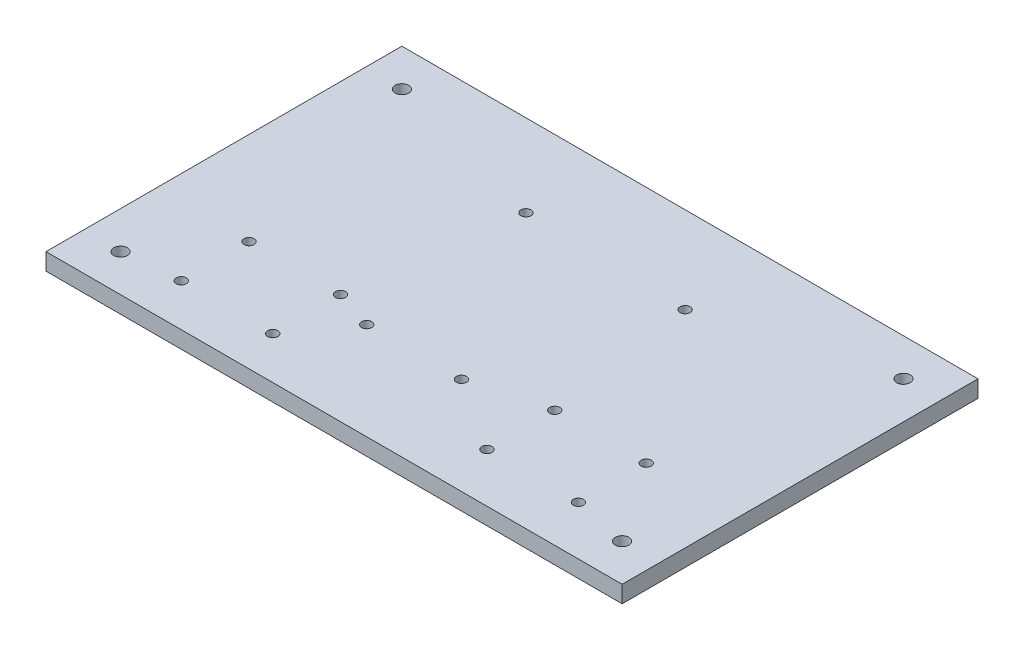
ISO-10303-21;
HEADER;
FILE_DESCRIPTION(('STEP AP214'),'2;1');
FILE_NAME('part.step','',(''),(''),'','','');
FILE_SCHEMA(('AUTOMOTIVE_DESIGN { 1 0 10303 214 1 1 1 1 }'));
ENDSEC;
DATA;
#1=APPLICATION_CONTEXT('core data for automotive mechanical design processes');
#2=APPLICATION_PROTOCOL_DEFINITION('international standard','automotive_design',2000,#1);
#3=PRODUCT_CONTEXT('',#1,'mechanical');
#4=PRODUCT('Part','Part','',(#3));
#5=PRODUCT_RELATED_PRODUCT_CATEGORY('part','',(#4));
#6=PRODUCT_DEFINITION_FORMATION('','',#4);
#7=PRODUCT_DEFINITION_CONTEXT('part definition',#1,'design');
#8=PRODUCT_DEFINITION('design','',#6,#7);
#9=PRODUCT_DEFINITION_SHAPE('','',#8);
#10=(LENGTH_UNIT() NAMED_UNIT(*) SI_UNIT(.MILLI.,.METRE.));
#11=(NAMED_UNIT(*) PLANE_ANGLE_UNIT() SI_UNIT($,.RADIAN.));
#12=(NAMED_UNIT(*) SI_UNIT($,.STERADIAN.) SOLID_ANGLE_UNIT());
#13=UNCERTAINTY_MEASURE_WITH_UNIT(LENGTH_MEASURE(1.E-05),#10,'distance_accuracy_value','');
#14=(GEOMETRIC_REPRESENTATION_CONTEXT(3) GLOBAL_UNCERTAINTY_ASSIGNED_CONTEXT((#13)) GLOBAL_UNIT_ASSIGNED_CONTEXT((#10,
#11,#12)) REPRESENTATION_CONTEXT('',''));
#15=CARTESIAN_POINT('',(0.,0.,0.));
#16=DIRECTION('',(0.,0.,1.));
#17=DIRECTION('',(1.,0.,0.));
#18=AXIS2_PLACEMENT_3D('',#15,#16,#17);
#19=CARTESIAN_POINT('',(115.6,5.,-14.5));
#20=DIRECTION('',(0.,-1.,0.));
#21=DIRECTION('',(0.,0.,-1.));
#22=AXIS2_PLACEMENT_3D('',#19,#20,#21);
#23=CYLINDRICAL_SURFACE('',#22,1.5);
#24=CARTESIAN_POINT('',(115.6,5.,-14.5));
#25=DIRECTION('',(0.,1.,0.));
#26=DIRECTION('',(0.,0.,1.));
#27=AXIS2_PLACEMENT_3D('',#24,#25,#26);
#28=CIRCLE('',#27,1.5);
#29=CARTESIAN_POINT('',(115.6,5.,-13.));
#30=VERTEX_POINT('',#29);
#31=EDGE_CURVE('E186',#30,#30,#28,.F.);
#32=ORIENTED_EDGE('',*,*,#31,.F.);
#33=EDGE_LOOP('',(#32));
#34=FACE_BOUND('',#33,.T.);
#35=CARTESIAN_POINT('',(115.6,0.,-14.5));
#36=DIRECTION('',(0.,1.,0.));
#37=DIRECTION('',(0.,0.,1.));
#38=AXIS2_PLACEMENT_3D('',#35,#36,#37);
#39=CIRCLE('',#38,1.5);
#40=CARTESIAN_POINT('',(115.6,0.,-13.));
#41=VERTEX_POINT('',#40);
#42=EDGE_CURVE('E242',#41,#41,#39,.F.);
#43=ORIENTED_EDGE('',*,*,#42,.T.);
#44=EDGE_LOOP('',(#43));
#45=FACE_BOUND('',#44,.T.);
#46=ADVANCED_FACE('F82',(#34,#45),#23,.F.);
#47=CARTESIAN_POINT('',(115.6,5.,-34.5));
#48=DIRECTION('',(0.,-1.,0.));
#49=DIRECTION('',(0.,0.,-1.));
#50=AXIS2_PLACEMENT_3D('',#47,#48,#49);
#51=CYLINDRICAL_SURFACE('',#50,1.5);
#52=CARTESIAN_POINT('',(115.6,5.,-34.5));
#53=DIRECTION('',(0.,1.,0.));
#54=DIRECTION('',(0.,0.,1.));
#55=AXIS2_PLACEMENT_3D('',#52,#53,#54);
#56=CIRCLE('',#55,1.5);
#57=CARTESIAN_POINT('',(115.6,5.,-33.));
#58=VERTEX_POINT('',#57);
#59=EDGE_CURVE('E183',#58,#58,#56,.T.);
#60=ORIENTED_EDGE('',*,*,#59,.T.);
#61=EDGE_LOOP('',(#60));
#62=FACE_BOUND('',#61,.T.);
#63=CARTESIAN_POINT('',(115.6,0.,-34.5));
#64=DIRECTION('',(0.,1.,0.));
#65=DIRECTION('',(0.,0.,1.));
#66=AXIS2_PLACEMENT_3D('',#63,#64,#65);
#67=CIRCLE('',#66,1.5);
#68=CARTESIAN_POINT('',(115.6,0.,-33.));
#69=VERTEX_POINT('',#68);
#70=EDGE_CURVE('E239',#69,#69,#67,.T.);
#71=ORIENTED_EDGE('',*,*,#70,.F.);
#72=EDGE_LOOP('',(#71));
#73=FACE_BOUND('',#72,.T.);
#74=ADVANCED_FACE('F270',(#62,#73),#51,.F.);
#75=CARTESIAN_POINT('',(142.6,5.,-34.5));
#76=DIRECTION('',(0.,-1.,0.));
#77=DIRECTION('',(0.,0.,-1.));
#78=AXIS2_PLACEMENT_3D('',#75,#76,#77);
#79=CYLINDRICAL_SURFACE('',#78,1.5);
#80=CARTESIAN_POINT('',(142.6,5.,-34.5));
#81=DIRECTION('',(0.,1.,0.));
#82=DIRECTION('',(0.,0.,1.));
#83=AXIS2_PLACEMENT_3D('',#80,#81,#82);
#84=CIRCLE('',#83,1.5);
#85=CARTESIAN_POINT('',(142.6,5.,-33.));
#86=VERTEX_POINT('',#85);
#87=EDGE_CURVE('E180',#86,#86,#84,.T.);
#88=ORIENTED_EDGE('',*,*,#87,.T.);
#89=EDGE_LOOP('',(#88));
#90=FACE_BOUND('',#89,.T.);
#91=CARTESIAN_POINT('',(142.6,0.,-34.5));
#92=DIRECTION('',(0.,1.,0.));
#93=DIRECTION('',(0.,0.,1.));
#94=AXIS2_PLACEMENT_3D('',#91,#92,#93);
#95=CIRCLE('',#94,1.5);
#96=CARTESIAN_POINT('',(142.6,0.,-33.));
#97=VERTEX_POINT('',#96);
#98=EDGE_CURVE('E236',#97,#97,#95,.T.);
#99=ORIENTED_EDGE('',*,*,#98,.F.);
#100=EDGE_LOOP('',(#99));
#101=FACE_BOUND('',#100,.T.);
#102=ADVANCED_FACE('F276',(#90,#101),#79,.F.);
#103=CARTESIAN_POINT('',(142.6,5.,-14.5));
#104=DIRECTION('',(0.,-1.,0.));
#105=DIRECTION('',(0.,0.,-1.));
#106=AXIS2_PLACEMENT_3D('',#103,#104,#105);
#107=CYLINDRICAL_SURFACE('',#106,1.5);
#108=CARTESIAN_POINT('',(142.6,5.,-14.5));
#109=DIRECTION('',(0.,1.,0.));
#110=DIRECTION('',(0.,0.,1.));
#111=AXIS2_PLACEMENT_3D('',#108,#109,#110);
#112=CIRCLE('',#111,1.5);
#113=CARTESIAN_POINT('',(142.6,5.,-13.));
#114=VERTEX_POINT('',#113);
#115=EDGE_CURVE('E177',#114,#114,#112,.F.);
#116=ORIENTED_EDGE('',*,*,#115,.F.);
#117=EDGE_LOOP('',(#116));
#118=FACE_BOUND('',#117,.T.);
#119=CARTESIAN_POINT('',(142.6,0.,-14.5));
#120=DIRECTION('',(0.,1.,0.));
#121=DIRECTION('',(0.,0.,1.));
#122=AXIS2_PLACEMENT_3D('',#119,#120,#121);
#123=CIRCLE('',#122,1.5);
#124=CARTESIAN_POINT('',(142.6,0.,-13.));
#125=VERTEX_POINT('',#124);
#126=EDGE_CURVE('E233',#125,#125,#123,.F.);
#127=ORIENTED_EDGE('',*,*,#126,.T.);
#128=EDGE_LOOP('',(#127));
#129=FACE_BOUND('',#128,.T.);
#130=ADVANCED_FACE('F283',(#118,#129),#107,.F.);
#131=CARTESIAN_POINT('',(60.88,5.,-80.73));
#132=DIRECTION('',(0.,-1.,0.));
#133=DIRECTION('',(0.,0.,-1.));
#134=AXIS2_PLACEMENT_3D('',#131,#132,#133);
#135=CYLINDRICAL_SURFACE('',#134,1.5);
#136=CARTESIAN_POINT('',(60.88,5.,-80.73));
#137=DIRECTION('',(0.,1.,0.));
#138=DIRECTION('',(0.,0.,1.));
#139=AXIS2_PLACEMENT_3D('',#136,#137,#138);
#140=CIRCLE('',#139,1.5);
#141=CARTESIAN_POINT('',(60.88,5.,-79.23));
#142=VERTEX_POINT('',#141);
#143=EDGE_CURVE('E174',#142,#142,#140,.T.);
#144=ORIENTED_EDGE('',*,*,#143,.T.);
#145=EDGE_LOOP('',(#144));
#146=FACE_BOUND('',#145,.T.);
#147=CARTESIAN_POINT('',(60.88,0.,-80.73));
#148=DIRECTION('',(0.,1.,0.));
#149=DIRECTION('',(0.,0.,1.));
#150=AXIS2_PLACEMENT_3D('',#147,#148,#149);
#151=CIRCLE('',#150,1.5);
#152=CARTESIAN_POINT('',(60.88,0.,-79.23));
#153=VERTEX_POINT('',#152);
#154=EDGE_CURVE('E230',#153,#153,#151,.T.);
#155=ORIENTED_EDGE('',*,*,#154,.F.);
#156=EDGE_LOOP('',(#155));
#157=FACE_BOUND('',#156,.T.);
#158=ADVANCED_FACE('F287',(#146,#157),#135,.F.);
#159=CARTESIAN_POINT('',(65.97,5.,-28.66));
#160=DIRECTION('',(0.,-1.,0.));
#161=DIRECTION('',(0.,0.,-1.));
#162=AXIS2_PLACEMENT_3D('',#159,#160,#161);
#163=CYLINDRICAL_SURFACE('',#162,1.5);
#164=CARTESIAN_POINT('',(65.97,5.,-28.66));
#165=DIRECTION('',(0.,1.,0.));
#166=DIRECTION('',(0.,0.,1.));
#167=AXIS2_PLACEMENT_3D('',#164,#165,#166);
#168=CIRCLE('',#167,1.5);
#169=CARTESIAN_POINT('',(65.97,5.,-27.16));
#170=VERTEX_POINT('',#169);
#171=EDGE_CURVE('E171',#170,#170,#168,.T.);
#172=ORIENTED_EDGE('',*,*,#171,.T.);
#173=EDGE_LOOP('',(#172));
#174=FACE_BOUND('',#173,.T.);
#175=CARTESIAN_POINT('',(65.97,0.,-28.66));
#176=DIRECTION('',(0.,1.,0.));
#177=DIRECTION('',(0.,0.,1.));
#178=AXIS2_PLACEMENT_3D('',#175,#176,#177);
#179=CIRCLE('',#178,1.5);
#180=CARTESIAN_POINT('',(65.97,0.,-27.16));
#181=VERTEX_POINT('',#180);
#182=EDGE_CURVE('E227',#181,#181,#179,.T.);
#183=ORIENTED_EDGE('',*,*,#182,.F.);
#184=EDGE_LOOP('',(#183));
#185=FACE_BOUND('',#184,.T.);
#186=ADVANCED_FACE('F291',(#174,#185),#163,.F.);
#187=CARTESIAN_POINT('',(93.92,5.,-28.66));
#188=DIRECTION('',(0.,-1.,0.));
#189=DIRECTION('',(0.,0.,-1.));
#190=AXIS2_PLACEMENT_3D('',#187,#188,#189);
#191=CYLINDRICAL_SURFACE('',#190,1.5);
#192=CARTESIAN_POINT('',(93.92,5.,-28.66));
#193=DIRECTION('',(0.,1.,0.));
#194=DIRECTION('',(0.,0.,1.));
#195=AXIS2_PLACEMENT_3D('',#192,#193,#194);
#196=CIRCLE('',#195,1.5);
#197=CARTESIAN_POINT('',(93.92,5.,-27.16));
#198=VERTEX_POINT('',#197);
#199=EDGE_CURVE('E168',#198,#198,#196,.T.);
#200=ORIENTED_EDGE('',*,*,#199,.T.);
#201=EDGE_LOOP('',(#200));
#202=FACE_BOUND('',#201,.T.);
#203=CARTESIAN_POINT('',(93.92,0.,-28.66));
#204=DIRECTION('',(0.,1.,0.));
#205=DIRECTION('',(0.,0.,1.));
#206=AXIS2_PLACEMENT_3D('',#203,#204,#205);
#207=CIRCLE('',#206,1.5);
#208=CARTESIAN_POINT('',(93.92,0.,-27.16));
#209=VERTEX_POINT('',#208);
#210=EDGE_CURVE('E224',#209,#209,#207,.T.);
#211=ORIENTED_EDGE('',*,*,#210,.F.);
#212=EDGE_LOOP('',(#211));
#213=FACE_BOUND('',#212,.T.);
#214=ADVANCED_FACE('F295',(#202,#213),#191,.F.);
#215=CARTESIAN_POINT('',(109.12,5.,-79.45));
#216=DIRECTION('',(0.,-1.,0.));
#217=DIRECTION('',(0.,0.,-1.));
#218=AXIS2_PLACEMENT_3D('',#215,#216,#217);
#219=CYLINDRICAL_SURFACE('',#218,1.5);
#220=CARTESIAN_POINT('',(109.12,5.,-79.45));
#221=DIRECTION('',(0.,1.,0.));
#222=DIRECTION('',(0.,0.,1.));
#223=AXIS2_PLACEMENT_3D('',#220,#221,#222);
#224=CIRCLE('',#223,1.5);
#225=CARTESIAN_POINT('',(109.12,5.,-77.95));
#226=VERTEX_POINT('',#225);
#227=EDGE_CURVE('E165',#226,#226,#224,.T.);
#228=ORIENTED_EDGE('',*,*,#227,.T.);
#229=EDGE_LOOP('',(#228));
#230=FACE_BOUND('',#229,.T.);
#231=CARTESIAN_POINT('',(109.12,0.,-79.45));
#232=DIRECTION('',(0.,1.,0.));
#233=DIRECTION('',(0.,0.,1.));
#234=AXIS2_PLACEMENT_3D('',#231,#232,#233);
#235=CIRCLE('',#234,1.5);
#236=CARTESIAN_POINT('',(109.12,0.,-77.95));
#237=VERTEX_POINT('',#236);
#238=EDGE_CURVE('E221',#237,#237,#235,.T.);
#239=ORIENTED_EDGE('',*,*,#238,.F.);
#240=EDGE_LOOP('',(#239));
#241=FACE_BOUND('',#240,.T.);
#242=ADVANCED_FACE('F299',(#230,#241),#219,.F.);
#243=CARTESIAN_POINT('',(27.4,5.,-32.5));
#244=DIRECTION('',(0.,-1.,0.));
#245=DIRECTION('',(0.,0.,-1.));
#246=AXIS2_PLACEMENT_3D('',#243,#244,#245);
#247=CYLINDRICAL_SURFACE('',#246,1.5);
#248=CARTESIAN_POINT('',(27.4,5.,-32.5));
#249=DIRECTION('',(0.,1.,0.));
#250=DIRECTION('',(0.,0.,1.));
#251=AXIS2_PLACEMENT_3D('',#248,#249,#250);
#252=CIRCLE('',#251,1.5);
#253=CARTESIAN_POINT('',(27.4,5.,-31.));
#254=VERTEX_POINT('',#253);
#255=EDGE_CURVE('E162',#254,#254,#252,.F.);
#256=ORIENTED_EDGE('',*,*,#255,.F.);
#257=EDGE_LOOP('',(#256));
#258=FACE_BOUND('',#257,.T.);
#259=CARTESIAN_POINT('',(27.4,0.,-32.5));
#260=DIRECTION('',(0.,1.,0.));
#261=DIRECTION('',(0.,0.,1.));
#262=AXIS2_PLACEMENT_3D('',#259,#260,#261);
#263=CIRCLE('',#262,1.5);
#264=CARTESIAN_POINT('',(27.4,0.,-31.));
#265=VERTEX_POINT('',#264);
#266=EDGE_CURVE('E218',#265,#265,#263,.F.);
#267=ORIENTED_EDGE('',*,*,#266,.T.);
#268=EDGE_LOOP('',(#267));
#269=FACE_BOUND('',#268,.T.);
#270=ADVANCED_FACE('F303',(#258,#269),#247,.F.);
#271=CARTESIAN_POINT('',(54.4,5.,-12.5));
#272=DIRECTION('',(0.,-1.,0.));
#273=DIRECTION('',(0.,0.,-1.));
#274=AXIS2_PLACEMENT_3D('',#271,#272,#273);
#275=CYLINDRICAL_SURFACE('',#274,1.5);
#276=CARTESIAN_POINT('',(54.4,5.,-12.5));
#277=DIRECTION('',(0.,1.,0.));
#278=DIRECTION('',(0.,0.,1.));
#279=AXIS2_PLACEMENT_3D('',#276,#277,#278);
#280=CIRCLE('',#279,1.5);
#281=CARTESIAN_POINT('',(54.4,5.,-11.));
#282=VERTEX_POINT('',#281);
#283=EDGE_CURVE('E159',#282,#282,#280,.T.);
#284=ORIENTED_EDGE('',*,*,#283,.T.);
#285=EDGE_LOOP('',(#284));
#286=FACE_BOUND('',#285,.T.);
#287=CARTESIAN_POINT('',(54.4,0.,-12.5));
#288=DIRECTION('',(0.,1.,0.));
#289=DIRECTION('',(0.,0.,1.));
#290=AXIS2_PLACEMENT_3D('',#287,#288,#289);
#291=CIRCLE('',#290,1.5);
#292=CARTESIAN_POINT('',(54.4,0.,-11.));
#293=VERTEX_POINT('',#292);
#294=EDGE_CURVE('E215',#293,#293,#291,.T.);
#295=ORIENTED_EDGE('',*,*,#294,.F.);
#296=EDGE_LOOP('',(#295));
#297=FACE_BOUND('',#296,.T.);
#298=ADVANCED_FACE('F307',(#286,#297),#275,.F.);
#299=CARTESIAN_POINT('',(27.4,5.,-12.5));
#300=DIRECTION('',(0.,-1.,0.));
#301=DIRECTION('',(0.,0.,-1.));
#302=AXIS2_PLACEMENT_3D('',#299,#300,#301);
#303=CYLINDRICAL_SURFACE('',#302,1.5);
#304=CARTESIAN_POINT('',(27.4,5.,-12.5));
#305=DIRECTION('',(0.,1.,0.));
#306=DIRECTION('',(0.,0.,1.));
#307=AXIS2_PLACEMENT_3D('',#304,#305,#306);
#308=CIRCLE('',#307,1.5);
#309=CARTESIAN_POINT('',(27.4,5.,-11.));
#310=VERTEX_POINT('',#309);
#311=EDGE_CURVE('E156',#310,#310,#308,.T.);
#312=ORIENTED_EDGE('',*,*,#311,.T.);
#313=EDGE_LOOP('',(#312));
#314=FACE_BOUND('',#313,.T.);
#315=CARTESIAN_POINT('',(27.4,0.,-12.5));
#316=DIRECTION('',(0.,1.,0.));
#317=DIRECTION('',(0.,0.,1.));
#318=AXIS2_PLACEMENT_3D('',#315,#316,#317);
#319=CIRCLE('',#318,1.5);
#320=CARTESIAN_POINT('',(27.4,0.,-11.));
#321=VERTEX_POINT('',#320);
#322=EDGE_CURVE('E212',#321,#321,#319,.T.);
#323=ORIENTED_EDGE('',*,*,#322,.F.);
#324=EDGE_LOOP('',(#323));
#325=FACE_BOUND('',#324,.T.);
#326=ADVANCED_FACE('F311',(#314,#325),#303,.F.);
#327=CARTESIAN_POINT('',(54.4,5.,-32.5));
#328=DIRECTION('',(0.,-1.,0.));
#329=DIRECTION('',(0.,0.,-1.));
#330=AXIS2_PLACEMENT_3D('',#327,#328,#329);
#331=CYLINDRICAL_SURFACE('',#330,1.5);
#332=CARTESIAN_POINT('',(54.4,5.,-32.5));
#333=DIRECTION('',(0.,1.,0.));
#334=DIRECTION('',(0.,0.,1.));
#335=AXIS2_PLACEMENT_3D('',#332,#333,#334);
#336=CIRCLE('',#335,1.5);
#337=CARTESIAN_POINT('',(54.4,5.,-31.));
#338=VERTEX_POINT('',#337);
#339=EDGE_CURVE('E153',#338,#338,#336,.F.);
#340=ORIENTED_EDGE('',*,*,#339,.F.);
#341=EDGE_LOOP('',(#340));
#342=FACE_BOUND('',#341,.T.);
#343=CARTESIAN_POINT('',(54.4,0.,-32.5));
#344=DIRECTION('',(0.,1.,0.));
#345=DIRECTION('',(0.,0.,1.));
#346=AXIS2_PLACEMENT_3D('',#343,#344,#345);
#347=CIRCLE('',#346,1.5);
#348=CARTESIAN_POINT('',(54.4,0.,-31.));
#349=VERTEX_POINT('',#348);
#350=EDGE_CURVE('E209',#349,#349,#347,.F.);
#351=ORIENTED_EDGE('',*,*,#350,.T.);
#352=EDGE_LOOP('',(#351));
#353=FACE_BOUND('',#352,.T.);
#354=ADVANCED_FACE('F315',(#342,#353),#331,.F.);
#355=CARTESIAN_POINT('',(159.,5.,-94.));
#356=DIRECTION('',(0.,-1.,0.));
#357=DIRECTION('',(0.,0.,-1.));
#358=AXIS2_PLACEMENT_3D('',#355,#356,#357);
#359=CYLINDRICAL_SURFACE('',#358,2.);
#360=CARTESIAN_POINT('',(159.,5.,-94.));
#361=DIRECTION('',(0.,1.,0.));
#362=DIRECTION('',(0.,0.,1.));
#363=AXIS2_PLACEMENT_3D('',#360,#361,#362);
#364=CIRCLE('',#363,2.);
#365=CARTESIAN_POINT('',(159.,5.,-92.));
#366=VERTEX_POINT('',#365);
#367=EDGE_CURVE('E150',#366,#366,#364,.F.);
#368=ORIENTED_EDGE('',*,*,#367,.F.);
#369=EDGE_LOOP('',(#368));
#370=FACE_BOUND('',#369,.T.);
#371=CARTESIAN_POINT('',(159.,0.,-94.));
#372=DIRECTION('',(0.,1.,0.));
#373=DIRECTION('',(0.,0.,1.));
#374=AXIS2_PLACEMENT_3D('',#371,#372,#373);
#375=CIRCLE('',#374,2.);
#376=CARTESIAN_POINT('',(159.,0.,-92.));
#377=VERTEX_POINT('',#376);
#378=EDGE_CURVE('E206',#377,#377,#375,.F.);
#379=ORIENTED_EDGE('',*,*,#378,.T.);
#380=EDGE_LOOP('',(#379));
#381=FACE_BOUND('',#380,.T.);
#382=ADVANCED_FACE('F319',(#370,#381),#359,.F.);
#383=CARTESIAN_POINT('',(159.,5.,-11.));
#384=DIRECTION('',(0.,-1.,0.));
#385=DIRECTION('',(0.,0.,-1.));
#386=AXIS2_PLACEMENT_3D('',#383,#384,#385);
#387=CYLINDRICAL_SURFACE('',#386,2.);
#388=CARTESIAN_POINT('',(159.,5.,-11.));
#389=DIRECTION('',(0.,1.,0.));
#390=DIRECTION('',(0.,0.,1.));
#391=AXIS2_PLACEMENT_3D('',#388,#389,#390);
#392=CIRCLE('',#391,2.);
#393=CARTESIAN_POINT('',(159.,5.,-9.00000000000003));
#394=VERTEX_POINT('',#393);
#395=EDGE_CURVE('E144',#394,#394,#392,.T.);
#396=ORIENTED_EDGE('',*,*,#395,.T.);
#397=EDGE_LOOP('',(#396));
#398=FACE_BOUND('',#397,.T.);
#399=CARTESIAN_POINT('',(159.,0.,-11.));
#400=DIRECTION('',(0.,1.,0.));
#401=DIRECTION('',(0.,0.,1.));
#402=AXIS2_PLACEMENT_3D('',#399,#400,#401);
#403=CIRCLE('',#402,2.);
#404=CARTESIAN_POINT('',(159.,0.,-9.00000000000003));
#405=VERTEX_POINT('',#404);
#406=EDGE_CURVE('E203',#405,#405,#403,.T.);
#407=ORIENTED_EDGE('',*,*,#406,.F.);
#408=EDGE_LOOP('',(#407));
#409=FACE_BOUND('',#408,.T.);
#410=ADVANCED_FACE('F323',(#398,#409),#387,.F.);
#411=CARTESIAN_POINT('',(170.,5.,0.));
#412=DIRECTION('',(-1.,0.,0.));
#413=DIRECTION('',(0.,0.,1.));
#414=AXIS2_PLACEMENT_3D('',#411,#412,#413);
#415=PLANE('',#414);
#416=DIRECTION('',(0.,0.,-1.));
#417=VECTOR('',#416,1.);
#418=CARTESIAN_POINT('',(170.,0.,0.));
#419=LINE('',#418,#417);
#420=CARTESIAN_POINT('',(170.,0.,0.));
#421=VERTEX_POINT('',#420);
#422=CARTESIAN_POINT('',(170.,0.,-105.));
#423=VERTEX_POINT('',#422);
#424=EDGE_CURVE('E138',#421,#423,#419,.T.);
#425=ORIENTED_EDGE('',*,*,#424,.T.);
#426=DIRECTION('',(0.,-1.,0.));
#427=VECTOR('',#426,1.);
#428=CARTESIAN_POINT('',(170.,5.,-105.));
#429=LINE('',#428,#427);
#430=CARTESIAN_POINT('',(170.,5.,-105.));
#431=VERTEX_POINT('',#430);
#432=EDGE_CURVE('E91',#431,#423,#429,.T.);
#433=ORIENTED_EDGE('',*,*,#432,.F.);
#434=DIRECTION('',(0.,0.,-1.));
#435=VECTOR('',#434,1.);
#436=CARTESIAN_POINT('',(170.,5.,0.));
#437=LINE('',#436,#435);
#438=CARTESIAN_POINT('',(170.,5.,0.));
#439=VERTEX_POINT('',#438);
#440=EDGE_CURVE('E124',#439,#431,#437,.T.);
#441=ORIENTED_EDGE('',*,*,#440,.F.);
#442=DIRECTION('',(0.,-1.,0.));
#443=VECTOR('',#442,1.);
#444=CARTESIAN_POINT('',(170.,5.,0.));
#445=LINE('',#444,#443);
#446=EDGE_CURVE('E12',#439,#421,#445,.T.);
#447=ORIENTED_EDGE('',*,*,#446,.T.);
#448=EDGE_LOOP('',(#425,#433,#441,#447));
#449=FACE_BOUND('',#448,.T.);
#450=ADVANCED_FACE('F137',(#449),#415,.F.);
#451=CARTESIAN_POINT('',(0.,5.,-105.));
#452=DIRECTION('',(0.,0.,-1.));
#453=DIRECTION('',(-1.,0.,0.));
#454=AXIS2_PLACEMENT_3D('',#451,#452,#453);
#455=PLANE('',#454);
#456=DIRECTION('',(1.,0.,0.));
#457=VECTOR('',#456,1.);
#458=CARTESIAN_POINT('',(0.,0.,-105.));
#459=LINE('',#458,#457);
#460=CARTESIAN_POINT('',(0.,0.,-105.));
#461=VERTEX_POINT('',#460);
#462=EDGE_CURVE('E198',#461,#423,#459,.T.);
#463=ORIENTED_EDGE('',*,*,#462,.F.);
#464=DIRECTION('',(0.,-1.,0.));
#465=VECTOR('',#464,1.);
#466=CARTESIAN_POINT('',(0.,5.,-105.));
#467=LINE('',#466,#465);
#468=CARTESIAN_POINT('',(0.,5.,-105.));
#469=VERTEX_POINT('',#468);
#470=EDGE_CURVE('E113',#469,#461,#467,.T.);
#471=ORIENTED_EDGE('',*,*,#470,.F.);
#472=DIRECTION('',(1.,0.,0.));
#473=VECTOR('',#472,1.);
#474=CARTESIAN_POINT('',(0.,5.,-105.));
#475=LINE('',#474,#473);
#476=EDGE_CURVE('E132',#469,#431,#475,.T.);
#477=ORIENTED_EDGE('',*,*,#476,.T.);
#478=ORIENTED_EDGE('',*,*,#432,.T.);
#479=EDGE_LOOP('',(#463,#471,#477,#478));
#480=FACE_BOUND('',#479,.T.);
#481=ADVANCED_FACE('F141',(#480),#455,.T.);
#482=CARTESIAN_POINT('',(0.,5.,0.));
#483=DIRECTION('',(-1.,0.,0.));
#484=DIRECTION('',(0.,0.,1.));
#485=AXIS2_PLACEMENT_3D('',#482,#483,#484);
#486=PLANE('',#485);
#487=DIRECTION('',(0.,0.,-1.));
#488=VECTOR('',#487,1.);
#489=CARTESIAN_POINT('',(0.,0.,0.));
#490=LINE('',#489,#488);
#491=CARTESIAN_POINT('',(0.,0.,0.));
#492=VERTEX_POINT('',#491);
#493=EDGE_CURVE('E200',#492,#461,#490,.T.);
#494=ORIENTED_EDGE('',*,*,#493,.F.);
#495=DIRECTION('',(0.,-1.,0.));
#496=VECTOR('',#495,1.);
#497=CARTESIAN_POINT('',(0.,5.,0.));
#498=LINE('',#497,#496);
#499=CARTESIAN_POINT('',(0.,5.,0.));
#500=VERTEX_POINT('',#499);
#501=EDGE_CURVE('E99',#500,#492,#498,.T.);
#502=ORIENTED_EDGE('',*,*,#501,.F.);
#503=DIRECTION('',(0.,0.,-1.));
#504=VECTOR('',#503,1.);
#505=CARTESIAN_POINT('',(0.,5.,0.));
#506=LINE('',#505,#504);
#507=EDGE_CURVE('E142',#500,#469,#506,.T.);
#508=ORIENTED_EDGE('',*,*,#507,.T.);
#509=ORIENTED_EDGE('',*,*,#470,.T.);
#510=EDGE_LOOP('',(#494,#502,#508,#509));
#511=FACE_BOUND('',#510,.T.);
#512=ADVANCED_FACE('F328',(#511),#486,.T.);
#513=CARTESIAN_POINT('',(0.,5.,0.));
#514=DIRECTION('',(0.,0.,-1.));
#515=DIRECTION('',(-1.,0.,0.));
#516=AXIS2_PLACEMENT_3D('',#513,#514,#515);
#517=PLANE('',#516);
#518=DIRECTION('',(1.,0.,0.));
#519=VECTOR('',#518,1.);
#520=CARTESIAN_POINT('',(0.,0.,0.));
#521=LINE('',#520,#519);
#522=EDGE_CURVE('E195',#492,#421,#521,.T.);
#523=ORIENTED_EDGE('',*,*,#522,.T.);
#524=ORIENTED_EDGE('',*,*,#446,.F.);
#525=DIRECTION('',(1.,0.,0.));
#526=VECTOR('',#525,1.);
#527=CARTESIAN_POINT('',(0.,5.,0.));
#528=LINE('',#527,#526);
#529=EDGE_CURVE('E133',#500,#439,#528,.T.);
#530=ORIENTED_EDGE('',*,*,#529,.F.);
#531=ORIENTED_EDGE('',*,*,#501,.T.);
#532=EDGE_LOOP('',(#523,#524,#530,#531));
#533=FACE_BOUND('',#532,.T.);
#534=ADVANCED_FACE('F331',(#533),#517,.F.);
#535=CARTESIAN_POINT('',(11.,5.,-94.));
#536=DIRECTION('',(0.,-1.,0.));
#537=DIRECTION('',(0.,0.,-1.));
#538=AXIS2_PLACEMENT_3D('',#535,#536,#537);
#539=CYLINDRICAL_SURFACE('',#538,2.);
#540=CARTESIAN_POINT('',(11.,5.,-94.));
#541=DIRECTION('',(0.,1.,0.));
#542=DIRECTION('',(0.,0.,1.));
#543=AXIS2_PLACEMENT_3D('',#540,#541,#542);
#544=CIRCLE('',#543,2.);
#545=CARTESIAN_POINT('',(11.,5.,-92.));
#546=VERTEX_POINT('',#545);
#547=EDGE_CURVE('E250',#546,#546,#544,.T.);
#548=ORIENTED_EDGE('',*,*,#547,.T.);
#549=EDGE_LOOP('',(#548));
#550=FACE_BOUND('',#549,.T.);
#551=CARTESIAN_POINT('',(11.,0.,-94.));
#552=DIRECTION('',(0.,1.,0.));
#553=DIRECTION('',(0.,0.,1.));
#554=AXIS2_PLACEMENT_3D('',#551,#552,#553);
#555=CIRCLE('',#554,2.);
#556=CARTESIAN_POINT('',(11.,0.,-92.));
#557=VERTEX_POINT('',#556);
#558=EDGE_CURVE('E192',#557,#557,#555,.T.);
#559=ORIENTED_EDGE('',*,*,#558,.F.);
#560=EDGE_LOOP('',(#559));
#561=FACE_BOUND('',#560,.T.);
#562=ADVANCED_FACE('F258',(#550,#561),#539,.F.);
#563=CARTESIAN_POINT('',(11.,5.,-11.));
#564=DIRECTION('',(0.,-1.,0.));
#565=DIRECTION('',(0.,0.,-1.));
#566=AXIS2_PLACEMENT_3D('',#563,#564,#565);
#567=CYLINDRICAL_SURFACE('',#566,2.);
#568=CARTESIAN_POINT('',(11.,5.,-11.));
#569=DIRECTION('',(0.,1.,0.));
#570=DIRECTION('',(0.,0.,1.));
#571=AXIS2_PLACEMENT_3D('',#568,#569,#570);
#572=CIRCLE('',#571,2.);
#573=CARTESIAN_POINT('',(11.,5.,-9.));
#574=VERTEX_POINT('',#573);
#575=EDGE_CURVE('E245',#574,#574,#572,.F.);
#576=ORIENTED_EDGE('',*,*,#575,.F.);
#577=EDGE_LOOP('',(#576));
#578=FACE_BOUND('',#577,.T.);
#579=CARTESIAN_POINT('',(11.,0.,-11.));
#580=DIRECTION('',(0.,1.,0.));
#581=DIRECTION('',(0.,0.,1.));
#582=AXIS2_PLACEMENT_3D('',#579,#580,#581);
#583=CIRCLE('',#582,2.);
#584=CARTESIAN_POINT('',(11.,0.,-9.));
#585=VERTEX_POINT('',#584);
#586=EDGE_CURVE('E189',#585,#585,#583,.F.);
#587=ORIENTED_EDGE('',*,*,#586,.T.);
#588=EDGE_LOOP('',(#587));
#589=FACE_BOUND('',#588,.T.);
#590=ADVANCED_FACE('F84',(#578,#589),#567,.F.);
#591=CARTESIAN_POINT('',(0.,0.,0.));
#592=DIRECTION('',(0.,1.,0.));
#593=DIRECTION('',(0.,0.,1.));
#594=AXIS2_PLACEMENT_3D('',#591,#592,#593);
#595=PLANE('',#594);
#596=ORIENTED_EDGE('',*,*,#586,.F.);
#597=EDGE_LOOP('',(#596));
#598=FACE_BOUND('',#597,.T.);
#599=ORIENTED_EDGE('',*,*,#558,.T.);
#600=EDGE_LOOP('',(#599));
#601=FACE_BOUND('',#600,.T.);
#602=ORIENTED_EDGE('',*,*,#522,.F.);
#603=ORIENTED_EDGE('',*,*,#493,.T.);
#604=ORIENTED_EDGE('',*,*,#462,.T.);
#605=ORIENTED_EDGE('',*,*,#424,.F.);
#606=EDGE_LOOP('',(#602,#603,#604,#605));
#607=FACE_BOUND('',#606,.T.);
#608=ORIENTED_EDGE('',*,*,#406,.T.);
#609=EDGE_LOOP('',(#608));
#610=FACE_BOUND('',#609,.T.);
#611=ORIENTED_EDGE('',*,*,#378,.F.);
#612=EDGE_LOOP('',(#611));
#613=FACE_BOUND('',#612,.T.);
#614=ORIENTED_EDGE('',*,*,#350,.F.);
#615=EDGE_LOOP('',(#614));
#616=FACE_BOUND('',#615,.T.);
#617=ORIENTED_EDGE('',*,*,#322,.T.);
#618=EDGE_LOOP('',(#617));
#619=FACE_BOUND('',#618,.T.);
#620=ORIENTED_EDGE('',*,*,#294,.T.);
#621=EDGE_LOOP('',(#620));
#622=FACE_BOUND('',#621,.T.);
#623=ORIENTED_EDGE('',*,*,#266,.F.);
#624=EDGE_LOOP('',(#623));
#625=FACE_BOUND('',#624,.T.);
#626=ORIENTED_EDGE('',*,*,#238,.T.);
#627=EDGE_LOOP('',(#626));
#628=FACE_BOUND('',#627,.T.);
#629=ORIENTED_EDGE('',*,*,#210,.T.);
#630=EDGE_LOOP('',(#629));
#631=FACE_BOUND('',#630,.T.);
#632=ORIENTED_EDGE('',*,*,#182,.T.);
#633=EDGE_LOOP('',(#632));
#634=FACE_BOUND('',#633,.T.);
#635=ORIENTED_EDGE('',*,*,#154,.T.);
#636=EDGE_LOOP('',(#635));
#637=FACE_BOUND('',#636,.T.);
#638=ORIENTED_EDGE('',*,*,#126,.F.);
#639=EDGE_LOOP('',(#638));
#640=FACE_BOUND('',#639,.T.);
#641=ORIENTED_EDGE('',*,*,#98,.T.);
#642=EDGE_LOOP('',(#641));
#643=FACE_BOUND('',#642,.T.);
#644=ORIENTED_EDGE('',*,*,#70,.T.);
#645=EDGE_LOOP('',(#644));
#646=FACE_BOUND('',#645,.T.);
#647=ORIENTED_EDGE('',*,*,#42,.F.);
#648=EDGE_LOOP('',(#647));
#649=FACE_BOUND('',#648,.T.);
#650=ADVANCED_FACE('F262',(#598,#601,#607,#610,#613,#616,#619,#622,#625,#628,#631,#634,#637,
#640,#643,#646,#649),#595,.F.);
#651=CARTESIAN_POINT('',(0.,5.,0.));
#652=DIRECTION('',(0.,1.,0.));
#653=DIRECTION('',(0.,0.,1.));
#654=AXIS2_PLACEMENT_3D('',#651,#652,#653);
#655=PLANE('',#654);
#656=ORIENTED_EDGE('',*,*,#575,.T.);
#657=EDGE_LOOP('',(#656));
#658=FACE_BOUND('',#657,.T.);
#659=ORIENTED_EDGE('',*,*,#547,.F.);
#660=EDGE_LOOP('',(#659));
#661=FACE_BOUND('',#660,.T.);
#662=ORIENTED_EDGE('',*,*,#529,.T.);
#663=ORIENTED_EDGE('',*,*,#440,.T.);
#664=ORIENTED_EDGE('',*,*,#476,.F.);
#665=ORIENTED_EDGE('',*,*,#507,.F.);
#666=EDGE_LOOP('',(#662,#663,#664,#665));
#667=FACE_BOUND('',#666,.T.);
#668=ORIENTED_EDGE('',*,*,#395,.F.);
#669=EDGE_LOOP('',(#668));
#670=FACE_BOUND('',#669,.T.);
#671=ORIENTED_EDGE('',*,*,#367,.T.);
#672=EDGE_LOOP('',(#671));
#673=FACE_BOUND('',#672,.T.);
#674=ORIENTED_EDGE('',*,*,#339,.T.);
#675=EDGE_LOOP('',(#674));
#676=FACE_BOUND('',#675,.T.);
#677=ORIENTED_EDGE('',*,*,#311,.F.);
#678=EDGE_LOOP('',(#677));
#679=FACE_BOUND('',#678,.T.);
#680=ORIENTED_EDGE('',*,*,#283,.F.);
#681=EDGE_LOOP('',(#680));
#682=FACE_BOUND('',#681,.T.);
#683=ORIENTED_EDGE('',*,*,#255,.T.);
#684=EDGE_LOOP('',(#683));
#685=FACE_BOUND('',#684,.T.);
#686=ORIENTED_EDGE('',*,*,#227,.F.);
#687=EDGE_LOOP('',(#686));
#688=FACE_BOUND('',#687,.T.);
#689=ORIENTED_EDGE('',*,*,#199,.F.);
#690=EDGE_LOOP('',(#689));
#691=FACE_BOUND('',#690,.T.);
#692=ORIENTED_EDGE('',*,*,#171,.F.);
#693=EDGE_LOOP('',(#692));
#694=FACE_BOUND('',#693,.T.);
#695=ORIENTED_EDGE('',*,*,#143,.F.);
#696=EDGE_LOOP('',(#695));
#697=FACE_BOUND('',#696,.T.);
#698=ORIENTED_EDGE('',*,*,#115,.T.);
#699=EDGE_LOOP('',(#698));
#700=FACE_BOUND('',#699,.T.);
#701=ORIENTED_EDGE('',*,*,#87,.F.);
#702=EDGE_LOOP('',(#701));
#703=FACE_BOUND('',#702,.T.);
#704=ORIENTED_EDGE('',*,*,#59,.F.);
#705=EDGE_LOOP('',(#704));
#706=FACE_BOUND('',#705,.T.);
#707=ORIENTED_EDGE('',*,*,#31,.T.);
#708=EDGE_LOOP('',(#707));
#709=FACE_BOUND('',#708,.T.);
#710=ADVANCED_FACE('F128',(#658,#661,#667,#670,#673,#676,#679,#682,#685,#688,#691,#694,#697,
#700,#703,#706,#709),#655,.T.);
#711=CLOSED_SHELL('',(#46,#74,#102,#130,#158,#186,#214,#242,#270,#298,#326,#354,#382,#410,#450,
#481,#512,#534,#562,#590,#650,#710));
#712=MANIFOLD_SOLID_BREP('B2',#711);
#713=ADVANCED_BREP_SHAPE_REPRESENTATION('',(#18,#712),#14);
#714=SHAPE_DEFINITION_REPRESENTATION(#9,#713);
ENDSEC;
END-ISO-10303-21;
